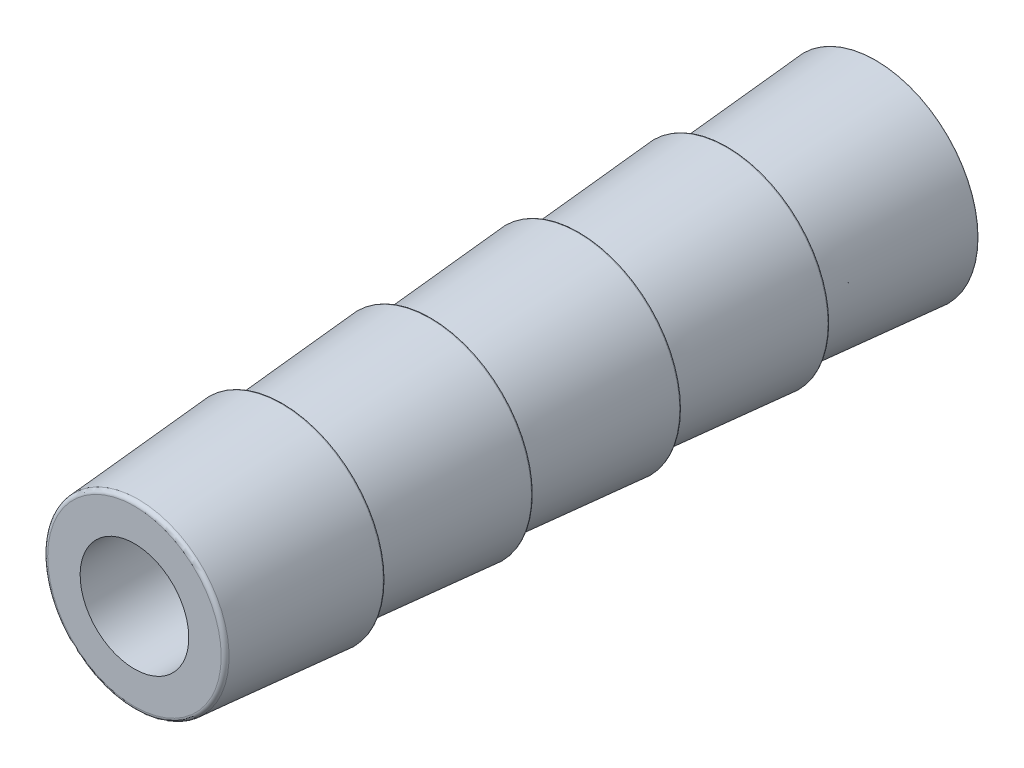
ISO-10303-21;
HEADER;
FILE_DESCRIPTION(('STEP AP214'),'2;1');
FILE_NAME('part.step','',(''),(''),'','','');
FILE_SCHEMA(('AUTOMOTIVE_DESIGN { 1 0 10303 214 1 1 1 1 }'));
ENDSEC;
DATA;
#1=APPLICATION_CONTEXT('core data for automotive mechanical design processes');
#2=APPLICATION_PROTOCOL_DEFINITION('international standard','automotive_design',2000,#1);
#3=PRODUCT_CONTEXT('',#1,'mechanical');
#4=PRODUCT('Part','Part','',(#3));
#5=PRODUCT_RELATED_PRODUCT_CATEGORY('part','',(#4));
#6=PRODUCT_DEFINITION_FORMATION('','',#4);
#7=PRODUCT_DEFINITION_CONTEXT('part definition',#1,'design');
#8=PRODUCT_DEFINITION('design','',#6,#7);
#9=PRODUCT_DEFINITION_SHAPE('','',#8);
#10=(LENGTH_UNIT() NAMED_UNIT(*) SI_UNIT(.MILLI.,.METRE.));
#11=(NAMED_UNIT(*) PLANE_ANGLE_UNIT() SI_UNIT($,.RADIAN.));
#12=(NAMED_UNIT(*) SI_UNIT($,.STERADIAN.) SOLID_ANGLE_UNIT());
#13=UNCERTAINTY_MEASURE_WITH_UNIT(LENGTH_MEASURE(1.E-05),#10,'distance_accuracy_value','');
#14=(GEOMETRIC_REPRESENTATION_CONTEXT(3) GLOBAL_UNCERTAINTY_ASSIGNED_CONTEXT((#13)) GLOBAL_UNIT_ASSIGNED_CONTEXT((#10,
#11,#12)) REPRESENTATION_CONTEXT('',''));
#15=CARTESIAN_POINT('',(0.,0.,0.));
#16=DIRECTION('',(0.,0.,1.));
#17=DIRECTION('',(1.,0.,0.));
#18=AXIS2_PLACEMENT_3D('',#15,#16,#17);
#19=CARTESIAN_POINT('',(-38.4084042323715,-17.8742252188409,33.9358700027938));
#20=DIRECTION('',(0.,0.,1.));
#21=DIRECTION('',(0.,-1.,0.));
#22=AXIS2_PLACEMENT_3D('',#19,#20,#21);
#23=TOROIDAL_SURFACE('',#22,3.12688179386419,0.04445);
#24=CARTESIAN_POINT('',(-38.4084042323715,-17.8742252188409,33.8914200027938));
#25=DIRECTION('',(0.,0.,1.));
#26=DIRECTION('',(0.,-1.,0.));
#27=AXIS2_PLACEMENT_3D('',#24,#25,#26);
#28=CIRCLE('',#27,3.12688179386419);
#29=CARTESIAN_POINT('',(-38.4084042323715,-21.0011070127051,33.8914200027938));
#30=VERTEX_POINT('',#29);
#31=EDGE_CURVE('E72',#30,#30,#28,.F.);
#32=ORIENTED_EDGE('',*,*,#31,.F.);
#33=EDGE_LOOP('',(#32));
#34=FACE_BOUND('',#33,.T.);
#35=CARTESIAN_POINT('',(-38.4084042323715,-17.8742252188409,33.9393873254277));
#36=DIRECTION('',(0.,0.,1.));
#37=DIRECTION('',(0.,-1.,0.));
#38=AXIS2_PLACEMENT_3D('',#35,#36,#37);
#39=CIRCLE('',#38,3.1711924126986);
#40=CARTESIAN_POINT('',(-38.4084042323715,-21.0454176315395,33.9393873254277));
#41=VERTEX_POINT('',#40);
#42=EDGE_CURVE('E90',#41,#41,#39,.T.);
#43=ORIENTED_EDGE('',*,*,#42,.F.);
#44=EDGE_LOOP('',(#43));
#45=FACE_BOUND('',#44,.T.);
#46=ADVANCED_FACE('F43',(#34,#45),#23,.T.);
#47=CARTESIAN_POINT('',(-38.4084042323715,-17.8742252188409,33.8914200027938));
#48=DIRECTION('',(0.,0.,-1.));
#49=DIRECTION('',(0.,1.,0.));
#50=AXIS2_PLACEMENT_3D('',#47,#48,#49);
#51=CONICAL_SURFACE('',#50,3.175,0.0792126806704457);
#52=CARTESIAN_POINT('',(-38.4084042323715,-17.8742252188409,38.4432339301598));
#53=DIRECTION('',(0.,0.,-1.));
#54=DIRECTION('',(0.,1.,0.));
#55=AXIS2_PLACEMENT_3D('',#52,#53,#54);
#56=CIRCLE('',#55,2.8136825873014);
#57=CARTESIAN_POINT('',(-38.4084042323715,-15.0605426315395,38.4432339301598));
#58=VERTEX_POINT('',#57);
#59=EDGE_CURVE('E93',#58,#58,#56,.T.);
#60=ORIENTED_EDGE('',*,*,#59,.T.);
#61=EDGE_LOOP('',(#60));
#62=FACE_BOUND('',#61,.T.);
#63=ORIENTED_EDGE('',*,*,#42,.T.);
#64=EDGE_LOOP('',(#63));
#65=FACE_BOUND('',#64,.T.);
#66=ADVANCED_FACE('F142',(#62,#65),#51,.T.);
#67=CARTESIAN_POINT('',(-38.4084042323715,-17.8742252188409,38.4467512527938));
#68=DIRECTION('',(0.,0.,1.));
#69=DIRECTION('',(0.,-1.,0.));
#70=AXIS2_PLACEMENT_3D('',#67,#68,#69);
#71=TOROIDAL_SURFACE('',#70,2.85799320613581,0.04445);
#72=ORIENTED_EDGE('',*,*,#59,.F.);
#73=EDGE_LOOP('',(#72));
#74=FACE_BOUND('',#73,.T.);
#75=CARTESIAN_POINT('',(-38.4084042323715,-17.8742252188409,38.4912012527938));
#76=DIRECTION('',(0.,0.,1.));
#77=DIRECTION('',(0.,-1.,0.));
#78=AXIS2_PLACEMENT_3D('',#75,#76,#77);
#79=CIRCLE('',#78,2.85799320613581);
#80=CARTESIAN_POINT('',(-38.4084042323715,-20.7322184249767,38.4912012527938));
#81=VERTEX_POINT('',#80);
#82=EDGE_CURVE('E87',#81,#81,#79,.T.);
#83=ORIENTED_EDGE('',*,*,#82,.F.);
#84=EDGE_LOOP('',(#83));
#85=FACE_BOUND('',#84,.T.);
#86=ADVANCED_FACE('F148',(#74,#85),#71,.F.);
#87=CARTESIAN_POINT('',(-38.4084042323715,-14.6992252188409,38.4912012527938));
#88=DIRECTION('',(0.,0.,1.));
#89=DIRECTION('',(0.,-1.,0.));
#90=AXIS2_PLACEMENT_3D('',#87,#88,#89);
#91=PLANE('',#90);
#92=ORIENTED_EDGE('',*,*,#82,.T.);
#93=EDGE_LOOP('',(#92));
#94=FACE_BOUND('',#93,.T.);
#95=CARTESIAN_POINT('',(-38.4084042323715,-17.8742252188409,38.4912012527938));
#96=DIRECTION('',(0.,0.,1.));
#97=DIRECTION('',(0.,-1.,0.));
#98=AXIS2_PLACEMENT_3D('',#95,#96,#97);
#99=CIRCLE('',#98,3.12688179386419);
#100=CARTESIAN_POINT('',(-38.4084042323715,-21.0011070127051,38.4912012527938));
#101=VERTEX_POINT('',#100);
#102=EDGE_CURVE('E84',#101,#101,#99,.F.);
#103=ORIENTED_EDGE('',*,*,#102,.T.);
#104=EDGE_LOOP('',(#103));
#105=FACE_BOUND('',#104,.T.);
#106=ADVANCED_FACE('F171',(#94,#105),#91,.F.);
#107=CARTESIAN_POINT('',(-38.4084042323715,-17.8742252188409,38.5356512527938));
#108=DIRECTION('',(0.,0.,1.));
#109=DIRECTION('',(0.,-1.,0.));
#110=AXIS2_PLACEMENT_3D('',#107,#108,#109);
#111=TOROIDAL_SURFACE('',#110,3.12688179386419,0.04445);
#112=ORIENTED_EDGE('',*,*,#102,.F.);
#113=EDGE_LOOP('',(#112));
#114=FACE_BOUND('',#113,.T.);
#115=CARTESIAN_POINT('',(-38.4084042323715,-17.8742252188409,38.5391685754277));
#116=DIRECTION('',(0.,0.,1.));
#117=DIRECTION('',(0.,-1.,0.));
#118=AXIS2_PLACEMENT_3D('',#115,#116,#117);
#119=CIRCLE('',#118,3.1711924126986);
#120=CARTESIAN_POINT('',(-38.4084042323715,-21.0454176315395,38.5391685754277));
#121=VERTEX_POINT('',#120);
#122=EDGE_CURVE('E102',#121,#121,#119,.T.);
#123=ORIENTED_EDGE('',*,*,#122,.F.);
#124=EDGE_LOOP('',(#123));
#125=FACE_BOUND('',#124,.T.);
#126=ADVANCED_FACE('F155',(#114,#125),#111,.T.);
#127=CARTESIAN_POINT('',(-38.4084042323715,-17.8742252188409,38.4912012527938));
#128=DIRECTION('',(0.,0.,-1.));
#129=DIRECTION('',(0.,1.,0.));
#130=AXIS2_PLACEMENT_3D('',#127,#128,#129);
#131=CONICAL_SURFACE('',#130,3.175,0.0792126806704457);
#132=CARTESIAN_POINT('',(-38.4084042323715,-17.8742252188409,43.0430151801598));
#133=DIRECTION('',(0.,0.,-1.));
#134=DIRECTION('',(0.,1.,0.));
#135=AXIS2_PLACEMENT_3D('',#132,#133,#134);
#136=CIRCLE('',#135,2.8136825873014);
#137=CARTESIAN_POINT('',(-38.4084042323715,-15.0605426315395,43.0430151801598));
#138=VERTEX_POINT('',#137);
#139=EDGE_CURVE('E105',#138,#138,#136,.T.);
#140=ORIENTED_EDGE('',*,*,#139,.T.);
#141=EDGE_LOOP('',(#140));
#142=FACE_BOUND('',#141,.T.);
#143=ORIENTED_EDGE('',*,*,#122,.T.);
#144=EDGE_LOOP('',(#143));
#145=FACE_BOUND('',#144,.T.);
#146=ADVANCED_FACE('F167',(#142,#145),#131,.T.);
#147=CARTESIAN_POINT('',(-38.4084042323715,-17.8742252188409,43.0465325027938));
#148=DIRECTION('',(0.,0.,1.));
#149=DIRECTION('',(0.,-1.,0.));
#150=AXIS2_PLACEMENT_3D('',#147,#148,#149);
#151=TOROIDAL_SURFACE('',#150,2.85799320613581,0.04445);
#152=ORIENTED_EDGE('',*,*,#139,.F.);
#153=EDGE_LOOP('',(#152));
#154=FACE_BOUND('',#153,.T.);
#155=CARTESIAN_POINT('',(-38.4084042323715,-17.8742252188409,43.0909825027938));
#156=DIRECTION('',(0.,0.,1.));
#157=DIRECTION('',(0.,-1.,0.));
#158=AXIS2_PLACEMENT_3D('',#155,#156,#157);
#159=CIRCLE('',#158,2.85799320613581);
#160=CARTESIAN_POINT('',(-38.4084042323715,-20.7322184249767,43.0909825027938));
#161=VERTEX_POINT('',#160);
#162=EDGE_CURVE('E99',#161,#161,#159,.T.);
#163=ORIENTED_EDGE('',*,*,#162,.F.);
#164=EDGE_LOOP('',(#163));
#165=FACE_BOUND('',#164,.T.);
#166=ADVANCED_FACE('F163',(#154,#165),#151,.F.);
#167=CARTESIAN_POINT('',(-38.4084042323715,-14.6992252188409,43.0909825027938));
#168=DIRECTION('',(0.,0.,1.));
#169=DIRECTION('',(0.,-1.,0.));
#170=AXIS2_PLACEMENT_3D('',#167,#168,#169);
#171=PLANE('',#170);
#172=ORIENTED_EDGE('',*,*,#162,.T.);
#173=EDGE_LOOP('',(#172));
#174=FACE_BOUND('',#173,.T.);
#175=CARTESIAN_POINT('',(-38.4084042323715,-17.8742252188409,43.0909825027938));
#176=DIRECTION('',(0.,0.,1.));
#177=DIRECTION('',(0.,-1.,0.));
#178=AXIS2_PLACEMENT_3D('',#175,#176,#177);
#179=CIRCLE('',#178,3.12688179386419);
#180=CARTESIAN_POINT('',(-38.4084042323715,-21.0011070127051,43.0909825027938));
#181=VERTEX_POINT('',#180);
#182=EDGE_CURVE('E96',#181,#181,#179,.F.);
#183=ORIENTED_EDGE('',*,*,#182,.T.);
#184=EDGE_LOOP('',(#183));
#185=FACE_BOUND('',#184,.T.);
#186=ADVANCED_FACE('F166',(#174,#185),#171,.F.);
#187=CARTESIAN_POINT('',(-38.4084042323715,-17.8742252188409,43.1354325027938));
#188=DIRECTION('',(0.,0.,1.));
#189=DIRECTION('',(0.,-1.,0.));
#190=AXIS2_PLACEMENT_3D('',#187,#188,#189);
#191=TOROIDAL_SURFACE('',#190,3.12688179386419,0.04445);
#192=ORIENTED_EDGE('',*,*,#182,.F.);
#193=EDGE_LOOP('',(#192));
#194=FACE_BOUND('',#193,.T.);
#195=CARTESIAN_POINT('',(-38.4084042323715,-17.8742252188409,43.1389498254277));
#196=DIRECTION('',(0.,0.,1.));
#197=DIRECTION('',(0.,-1.,0.));
#198=AXIS2_PLACEMENT_3D('',#195,#196,#197);
#199=CIRCLE('',#198,3.1711924126986);
#200=CARTESIAN_POINT('',(-38.4084042323715,-21.0454176315395,43.1389498254277));
#201=VERTEX_POINT('',#200);
#202=EDGE_CURVE('E108',#201,#201,#199,.T.);
#203=ORIENTED_EDGE('',*,*,#202,.F.);
#204=EDGE_LOOP('',(#203));
#205=FACE_BOUND('',#204,.T.);
#206=ADVANCED_FACE('F188',(#194,#205),#191,.T.);
#207=CARTESIAN_POINT('',(-38.4084042323715,-17.8742252188409,43.0909825027938));
#208=DIRECTION('',(0.,0.,-1.));
#209=DIRECTION('',(0.,1.,0.));
#210=AXIS2_PLACEMENT_3D('',#207,#208,#209);
#211=CONICAL_SURFACE('',#210,3.175,0.0792126806704456);
#212=ORIENTED_EDGE('',*,*,#202,.T.);
#213=EDGE_LOOP('',(#212));
#214=FACE_BOUND('',#213,.T.);
#215=CARTESIAN_POINT('',(-38.4084042323715,-17.8742252188409,47.5738132460337));
#216=DIRECTION('',(0.,0.,1.));
#217=DIRECTION('',(0.,-1.,0.));
#218=AXIS2_PLACEMENT_3D('',#215,#216,#217);
#219=CIRCLE('',#218,2.81915838793954);
#220=CARTESIAN_POINT('',(-38.4084042323715,-20.6933836067804,47.5738132460337));
#221=VERTEX_POINT('',#220);
#222=EDGE_CURVE('E58',#221,#221,#219,.F.);
#223=ORIENTED_EDGE('',*,*,#222,.T.);
#224=EDGE_LOOP('',(#223));
#225=FACE_BOUND('',#224,.T.);
#226=ADVANCED_FACE('F183',(#214,#225),#211,.T.);
#227=CARTESIAN_POINT('',(-38.4084042323715,-17.8742252188409,47.5637637527938));
#228=DIRECTION('',(0.,0.,-1.));
#229=DIRECTION('',(0.,1.,0.));
#230=AXIS2_PLACEMENT_3D('',#227,#228,#229);
#231=TOROIDAL_SURFACE('',#230,2.69255661984122,0.127);
#232=ORIENTED_EDGE('',*,*,#222,.F.);
#233=EDGE_LOOP('',(#232));
#234=FACE_BOUND('',#233,.T.);
#235=CARTESIAN_POINT('',(-38.4084042323715,-17.8742252188409,47.6907637527938));
#236=DIRECTION('',(0.,0.,-1.));
#237=DIRECTION('',(0.,1.,0.));
#238=AXIS2_PLACEMENT_3D('',#235,#236,#237);
#239=CIRCLE('',#238,2.69255661984122);
#240=CARTESIAN_POINT('',(-38.4084042323715,-15.1816685989996,47.6907637527938));
#241=VERTEX_POINT('',#240);
#242=EDGE_CURVE('E54',#241,#241,#239,.F.);
#243=ORIENTED_EDGE('',*,*,#242,.F.);
#244=EDGE_LOOP('',(#243));
#245=FACE_BOUND('',#244,.T.);
#246=ADVANCED_FACE('F138',(#234,#245),#231,.T.);
#247=CARTESIAN_POINT('',(-38.4084042323715,-16.1883002188409,47.6907637527938));
#248=DIRECTION('',(0.,0.,-1.));
#249=DIRECTION('',(0.,1.,0.));
#250=AXIS2_PLACEMENT_3D('',#247,#248,#249);
#251=PLANE('',#250);
#252=ORIENTED_EDGE('',*,*,#242,.T.);
#253=EDGE_LOOP('',(#252));
#254=FACE_BOUND('',#253,.T.);
#255=CARTESIAN_POINT('',(-38.4084042323715,-17.8742252188409,47.6907637527938));
#256=DIRECTION('',(0.,0.,1.));
#257=DIRECTION('',(0.,-1.,0.));
#258=AXIS2_PLACEMENT_3D('',#255,#256,#257);
#259=CIRCLE('',#258,1.685925);
#260=CARTESIAN_POINT('',(-38.4084042323715,-19.5601502188409,47.6907637527938));
#261=VERTEX_POINT('',#260);
#262=EDGE_CURVE('E10',#261,#261,#259,.T.);
#263=ORIENTED_EDGE('',*,*,#262,.F.);
#264=EDGE_LOOP('',(#263));
#265=FACE_BOUND('',#264,.T.);
#266=ADVANCED_FACE('F129',(#254,#265),#251,.F.);
#267=CARTESIAN_POINT('',(-38.4084042323715,-17.8742252188409,32.4110762527938));
#268=DIRECTION('',(0.,0.,1.));
#269=DIRECTION('',(0.,-1.,0.));
#270=AXIS2_PLACEMENT_3D('',#267,#268,#269);
#271=CYLINDRICAL_SURFACE('',#270,1.685925);
#272=CARTESIAN_POINT('',(-38.4084042323715,-17.8742252188409,24.6868248657935));
#273=DIRECTION('',(0.,0.,1.));
#274=DIRECTION('',(1.,0.,0.));
#275=AXIS2_PLACEMENT_3D('',#272,#273,#274);
#276=CIRCLE('',#275,1.685925);
#277=CARTESIAN_POINT('',(-36.7224792323715,-17.8742252188409,24.6868248657935));
#278=VERTEX_POINT('',#277);
#279=EDGE_CURVE('E111',#278,#278,#276,.F.);
#280=ORIENTED_EDGE('',*,*,#279,.T.);
#281=EDGE_LOOP('',(#280));
#282=FACE_BOUND('',#281,.T.);
#283=ORIENTED_EDGE('',*,*,#262,.T.);
#284=EDGE_LOOP('',(#283));
#285=FACE_BOUND('',#284,.T.);
#286=ADVANCED_FACE('F45',(#282,#285),#271,.F.);
#287=CARTESIAN_POINT('',(-38.4084042323715,-14.6992252188409,33.8914200027938));
#288=DIRECTION('',(0.,0.,1.));
#289=DIRECTION('',(0.,-1.,0.));
#290=AXIS2_PLACEMENT_3D('',#287,#288,#289);
#291=PLANE('',#290);
#292=CARTESIAN_POINT('',(-38.4084042323715,-17.8742252188409,33.8914200027938));
#293=DIRECTION('',(0.,0.,1.));
#294=DIRECTION('',(0.,-1.,0.));
#295=AXIS2_PLACEMENT_3D('',#292,#293,#294);
#296=CIRCLE('',#295,2.85799320613581);
#297=CARTESIAN_POINT('',(-38.4084042323715,-20.7322184249767,33.8914200027938));
#298=VERTEX_POINT('',#297);
#299=EDGE_CURVE('E75',#298,#298,#296,.T.);
#300=ORIENTED_EDGE('',*,*,#299,.T.);
#301=EDGE_LOOP('',(#300));
#302=FACE_BOUND('',#301,.T.);
#303=ORIENTED_EDGE('',*,*,#31,.T.);
#304=EDGE_LOOP('',(#303));
#305=FACE_BOUND('',#304,.T.);
#306=ADVANCED_FACE('F128',(#302,#305),#291,.F.);
#307=CARTESIAN_POINT('',(-38.4084042323715,-17.8742252188409,33.8469700027938));
#308=DIRECTION('',(0.,0.,1.));
#309=DIRECTION('',(0.,-1.,0.));
#310=AXIS2_PLACEMENT_3D('',#307,#308,#309);
#311=TOROIDAL_SURFACE('',#310,2.85799320613581,0.04445);
#312=CARTESIAN_POINT('',(-38.4084042323715,-17.8742252188409,33.8434526801598));
#313=DIRECTION('',(0.,0.,-1.));
#314=DIRECTION('',(0.,1.,0.));
#315=AXIS2_PLACEMENT_3D('',#312,#313,#314);
#316=CIRCLE('',#315,2.8136825873014);
#317=CARTESIAN_POINT('',(-38.4084042323715,-15.0605426315395,33.8434526801598));
#318=VERTEX_POINT('',#317);
#319=EDGE_CURVE('E81',#318,#318,#316,.T.);
#320=ORIENTED_EDGE('',*,*,#319,.F.);
#321=EDGE_LOOP('',(#320));
#322=FACE_BOUND('',#321,.T.);
#323=ORIENTED_EDGE('',*,*,#299,.F.);
#324=EDGE_LOOP('',(#323));
#325=FACE_BOUND('',#324,.T.);
#326=ADVANCED_FACE('F134',(#322,#325),#311,.F.);
#327=CARTESIAN_POINT('',(-38.4084042323715,-17.8742252188409,29.2916387527938));
#328=DIRECTION('',(0.,0.,-1.));
#329=DIRECTION('',(0.,1.,0.));
#330=AXIS2_PLACEMENT_3D('',#327,#328,#329);
#331=CONICAL_SURFACE('',#330,3.175,0.0792126806704458);
#332=ORIENTED_EDGE('',*,*,#319,.T.);
#333=EDGE_LOOP('',(#332));
#334=FACE_BOUND('',#333,.T.);
#335=CARTESIAN_POINT('',(-38.4084042323715,-17.8742252188409,29.3396060754277));
#336=DIRECTION('',(0.,0.,1.));
#337=DIRECTION('',(0.,-1.,0.));
#338=AXIS2_PLACEMENT_3D('',#335,#336,#337);
#339=CIRCLE('',#338,3.1711924126986);
#340=CARTESIAN_POINT('',(-38.4084042323715,-21.0454176315395,29.3396060754277));
#341=VERTEX_POINT('',#340);
#342=EDGE_CURVE('E78',#341,#341,#339,.T.);
#343=ORIENTED_EDGE('',*,*,#342,.T.);
#344=EDGE_LOOP('',(#343));
#345=FACE_BOUND('',#344,.T.);
#346=ADVANCED_FACE('F161',(#334,#345),#331,.T.);
#347=CARTESIAN_POINT('',(-38.4084042323715,-17.8742252188409,29.3360887527938));
#348=DIRECTION('',(0.,0.,1.));
#349=DIRECTION('',(0.,-1.,0.));
#350=AXIS2_PLACEMENT_3D('',#347,#348,#349);
#351=TOROIDAL_SURFACE('',#350,3.12688179386419,0.04445);
#352=CARTESIAN_POINT('',(-38.4084042323715,-17.8742252188409,29.2916387527938));
#353=DIRECTION('',(0.,0.,1.));
#354=DIRECTION('',(0.,-1.,0.));
#355=AXIS2_PLACEMENT_3D('',#352,#353,#354);
#356=CIRCLE('',#355,3.12688179386419);
#357=CARTESIAN_POINT('',(-38.4084042323715,-21.0011070127051,29.2916387527938));
#358=VERTEX_POINT('',#357);
#359=EDGE_CURVE('E63',#358,#358,#356,.F.);
#360=ORIENTED_EDGE('',*,*,#359,.F.);
#361=EDGE_LOOP('',(#360));
#362=FACE_BOUND('',#361,.T.);
#363=ORIENTED_EDGE('',*,*,#342,.F.);
#364=EDGE_LOOP('',(#363));
#365=FACE_BOUND('',#364,.T.);
#366=ADVANCED_FACE('F157',(#362,#365),#351,.T.);
#367=CARTESIAN_POINT('',(-38.4084042323715,-14.6992252188409,29.2916387527938));
#368=DIRECTION('',(0.,0.,1.));
#369=DIRECTION('',(0.,-1.,0.));
#370=AXIS2_PLACEMENT_3D('',#367,#368,#369);
#371=PLANE('',#370);
#372=CARTESIAN_POINT('',(-38.4084042323715,-17.8742252188409,29.2916387527938));
#373=DIRECTION('',(0.,0.,1.));
#374=DIRECTION('',(0.,-1.,0.));
#375=AXIS2_PLACEMENT_3D('',#372,#373,#374);
#376=CIRCLE('',#375,2.85799320613581);
#377=CARTESIAN_POINT('',(-38.4084042323715,-20.7322184249767,29.2916387527938));
#378=VERTEX_POINT('',#377);
#379=EDGE_CURVE('E66',#378,#378,#376,.T.);
#380=ORIENTED_EDGE('',*,*,#379,.T.);
#381=EDGE_LOOP('',(#380));
#382=FACE_BOUND('',#381,.T.);
#383=ORIENTED_EDGE('',*,*,#359,.T.);
#384=EDGE_LOOP('',(#383));
#385=FACE_BOUND('',#384,.T.);
#386=ADVANCED_FACE('F160',(#382,#385),#371,.F.);
#387=CARTESIAN_POINT('',(-38.4084042323715,-17.8742252188409,29.2471887527938));
#388=DIRECTION('',(0.,0.,1.));
#389=DIRECTION('',(0.,-1.,0.));
#390=AXIS2_PLACEMENT_3D('',#387,#388,#389);
#391=TOROIDAL_SURFACE('',#390,2.85799320613581,0.04445);
#392=CARTESIAN_POINT('',(-38.4084042323715,-17.8742252188409,29.2436714301598));
#393=DIRECTION('',(0.,0.,-1.));
#394=DIRECTION('',(0.,1.,0.));
#395=AXIS2_PLACEMENT_3D('',#392,#393,#394);
#396=CIRCLE('',#395,2.8136825873014);
#397=CARTESIAN_POINT('',(-38.4084042323715,-15.0605426315395,29.2436714301598));
#398=VERTEX_POINT('',#397);
#399=EDGE_CURVE('E69',#398,#398,#396,.T.);
#400=ORIENTED_EDGE('',*,*,#399,.F.);
#401=EDGE_LOOP('',(#400));
#402=FACE_BOUND('',#401,.T.);
#403=ORIENTED_EDGE('',*,*,#379,.F.);
#404=EDGE_LOOP('',(#403));
#405=FACE_BOUND('',#404,.T.);
#406=ADVANCED_FACE('F176',(#402,#405),#391,.F.);
#407=CARTESIAN_POINT('',(-38.4084042323715,-17.8742252188409,24.6918575027938));
#408=DIRECTION('',(0.,0.,-1.));
#409=DIRECTION('',(0.,1.,0.));
#410=AXIS2_PLACEMENT_3D('',#407,#408,#409);
#411=CONICAL_SURFACE('',#410,3.175,0.0792126806704457);
#412=ORIENTED_EDGE('',*,*,#399,.T.);
#413=EDGE_LOOP('',(#412));
#414=FACE_BOUND('',#413,.T.);
#415=CARTESIAN_POINT('',(-38.4084042323715,-17.8742252188409,24.6968743590334));
#416=DIRECTION('',(0.,0.,1.));
#417=DIRECTION('',(0.,-1.,0.));
#418=AXIS2_PLACEMENT_3D('',#415,#416,#417);
#419=CIRCLE('',#418,3.17460176809832);
#420=CARTESIAN_POINT('',(-38.4084042323715,-21.0488269869392,24.6968743590334));
#421=VERTEX_POINT('',#420);
#422=EDGE_CURVE('E50',#421,#421,#419,.T.);
#423=ORIENTED_EDGE('',*,*,#422,.T.);
#424=EDGE_LOOP('',(#423));
#425=FACE_BOUND('',#424,.T.);
#426=ADVANCED_FACE('F179',(#414,#425),#411,.T.);
#427=CARTESIAN_POINT('',(-38.4084042323715,-17.8742252188409,24.6868248657935));
#428=DIRECTION('',(0.,0.,-1.));
#429=DIRECTION('',(0.,1.,0.));
#430=AXIS2_PLACEMENT_3D('',#427,#428,#429);
#431=TOROIDAL_SURFACE('',#430,3.048,0.127);
#432=CARTESIAN_POINT('',(-38.4084042323715,-17.8742252188409,24.6868248657935));
#433=DIRECTION('',(0.,0.,1.));
#434=DIRECTION('',(1.,0.,0.));
#435=AXIS2_PLACEMENT_3D('',#432,#433,#434);
#436=CIRCLE('',#435,3.175);
#437=CARTESIAN_POINT('',(-35.2334042323715,-17.8742252188409,24.6868248657935));
#438=VERTEX_POINT('',#437);
#439=EDGE_CURVE('E114',#438,#438,#436,.T.);
#440=ORIENTED_EDGE('',*,*,#439,.T.);
#441=EDGE_LOOP('',(#440));
#442=FACE_BOUND('',#441,.T.);
#443=ORIENTED_EDGE('',*,*,#422,.F.);
#444=EDGE_LOOP('',(#443));
#445=FACE_BOUND('',#444,.T.);
#446=ADVANCED_FACE('F118',(#442,#445),#431,.T.);
#447=CARTESIAN_POINT('',(-50.189387772472,-45.466,24.6868248657935));
#448=DIRECTION('',(0.,0.,1.));
#449=DIRECTION('',(1.,0.,0.));
#450=AXIS2_PLACEMENT_3D('',#447,#448,#449);
#451=PLANE('',#450);
#452=ORIENTED_EDGE('',*,*,#439,.F.);
#453=EDGE_LOOP('',(#452));
#454=FACE_BOUND('',#453,.T.);
#455=ORIENTED_EDGE('',*,*,#279,.F.);
#456=EDGE_LOOP('',(#455));
#457=FACE_BOUND('',#456,.T.);
#458=ADVANCED_FACE('F121',(#454,#457),#451,.F.);
#459=CLOSED_SHELL('',(#46,#66,#86,#106,#126,#146,#166,#186,#206,#226,#246,#266,#286,#306,#326,
#346,#366,#386,#406,#426,#446,#458));
#460=MANIFOLD_SOLID_BREP('B2',#459);
#461=ADVANCED_BREP_SHAPE_REPRESENTATION('',(#18,#460),#14);
#462=SHAPE_DEFINITION_REPRESENTATION(#9,#461);
ENDSEC;
END-ISO-10303-21;
